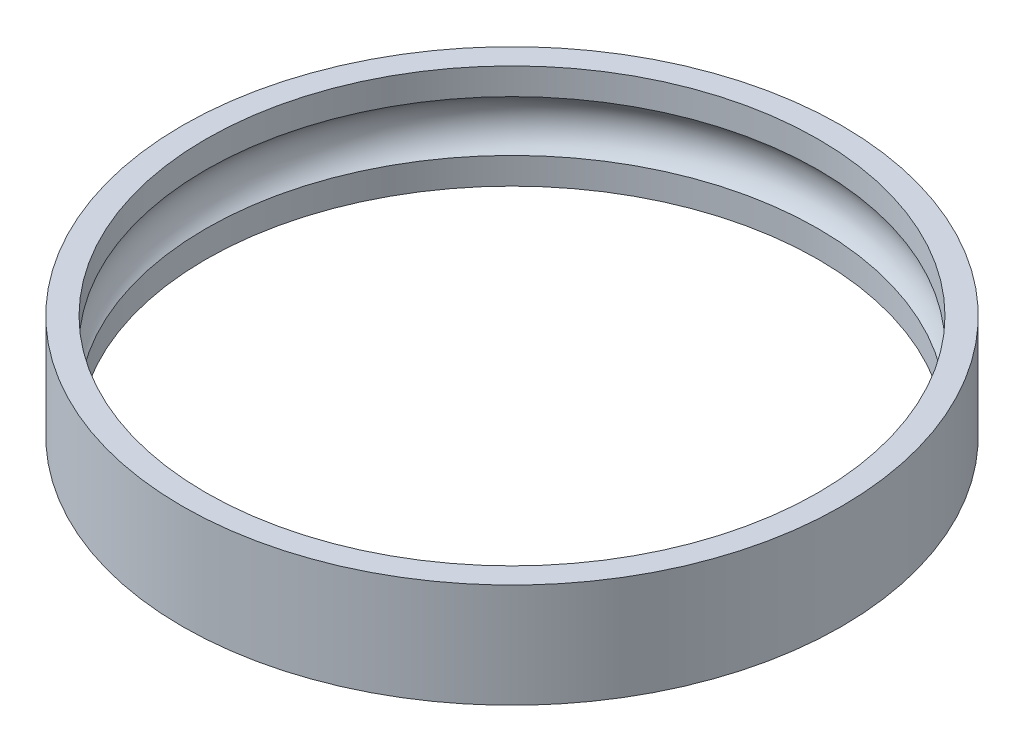
ISO-10303-21;
HEADER;
FILE_DESCRIPTION(('STEP AP214'),'2;1');
FILE_NAME('part.step','',(''),(''),'','','');
FILE_SCHEMA(('AUTOMOTIVE_DESIGN { 1 0 10303 214 1 1 1 1 }'));
ENDSEC;
DATA;
#1=APPLICATION_CONTEXT('core data for automotive mechanical design processes');
#2=APPLICATION_PROTOCOL_DEFINITION('international standard','automotive_design',2000,#1);
#3=PRODUCT_CONTEXT('',#1,'mechanical');
#4=PRODUCT('Part','Part','',(#3));
#5=PRODUCT_RELATED_PRODUCT_CATEGORY('part','',(#4));
#6=PRODUCT_DEFINITION_FORMATION('','',#4);
#7=PRODUCT_DEFINITION_CONTEXT('part definition',#1,'design');
#8=PRODUCT_DEFINITION('design','',#6,#7);
#9=PRODUCT_DEFINITION_SHAPE('','',#8);
#10=(LENGTH_UNIT() NAMED_UNIT(*) SI_UNIT(.MILLI.,.METRE.));
#11=(NAMED_UNIT(*) PLANE_ANGLE_UNIT() SI_UNIT($,.RADIAN.));
#12=(NAMED_UNIT(*) SI_UNIT($,.STERADIAN.) SOLID_ANGLE_UNIT());
#13=UNCERTAINTY_MEASURE_WITH_UNIT(LENGTH_MEASURE(1.E-05),#10,'distance_accuracy_value','');
#14=(GEOMETRIC_REPRESENTATION_CONTEXT(3) GLOBAL_UNCERTAINTY_ASSIGNED_CONTEXT((#13)) GLOBAL_UNIT_ASSIGNED_CONTEXT((#10,
#11,#12)) REPRESENTATION_CONTEXT('',''));
#15=CARTESIAN_POINT('',(0.,0.,0.));
#16=DIRECTION('',(0.,0.,1.));
#17=DIRECTION('',(1.,0.,0.));
#18=AXIS2_PLACEMENT_3D('',#15,#16,#17);
#19=CARTESIAN_POINT('',(0.,0.,0.));
#20=DIRECTION('',(0.,-1.,0.));
#21=DIRECTION('',(0.,0.,-1.));
#22=AXIS2_PLACEMENT_3D('',#19,#20,#21);
#23=CYLINDRICAL_SURFACE('',#22,9.11499999999751);
#24=CARTESIAN_POINT('',(0.,-3.2,0.));
#25=DIRECTION('',(0.,-1.,0.));
#26=DIRECTION('',(0.,0.,-1.));
#27=AXIS2_PLACEMENT_3D('',#24,#25,#26);
#28=CIRCLE('',#27,9.11499999999751);
#29=CARTESIAN_POINT('',(0.,-3.2,-9.11499999999751));
#30=VERTEX_POINT('',#29);
#31=EDGE_CURVE('E19',#30,#30,#28,.T.);
#32=ORIENTED_EDGE('',*,*,#31,.T.);
#33=EDGE_LOOP('',(#32));
#34=FACE_BOUND('',#33,.T.);
#35=CARTESIAN_POINT('',(0.,-2.40778872385596,0.));
#36=DIRECTION('',(0.,-1.,0.));
#37=DIRECTION('',(0.,0.,-1.));
#38=AXIS2_PLACEMENT_3D('',#35,#36,#37);
#39=CIRCLE('',#38,9.11499999999751);
#40=CARTESIAN_POINT('',(0.,-2.40778872385596,-9.11499999999751));
#41=VERTEX_POINT('',#40);
#42=EDGE_CURVE('E43',#41,#41,#39,.T.);
#43=ORIENTED_EDGE('',*,*,#42,.F.);
#44=EDGE_LOOP('',(#43));
#45=FACE_BOUND('',#44,.T.);
#46=ADVANCED_FACE('F15',(#34,#45),#23,.F.);
#47=CARTESIAN_POINT('',(9.115,-3.2,0.));
#48=DIRECTION('',(0.,-1.,0.));
#49=DIRECTION('',(0.,0.,-1.));
#50=AXIS2_PLACEMENT_3D('',#47,#48,#49);
#51=PLANE('',#50);
#52=CARTESIAN_POINT('',(0.,-3.2,0.));
#53=DIRECTION('',(0.,-1.,0.));
#54=DIRECTION('',(0.,0.,-1.));
#55=AXIS2_PLACEMENT_3D('',#52,#53,#54);
#56=CIRCLE('',#55,9.815);
#57=CARTESIAN_POINT('',(0.,-3.2,-9.815));
#58=VERTEX_POINT('',#57);
#59=EDGE_CURVE('E40',#58,#58,#56,.T.);
#60=ORIENTED_EDGE('',*,*,#59,.T.);
#61=EDGE_LOOP('',(#60));
#62=FACE_BOUND('',#61,.T.);
#63=ORIENTED_EDGE('',*,*,#31,.F.);
#64=EDGE_LOOP('',(#63));
#65=FACE_BOUND('',#64,.T.);
#66=ADVANCED_FACE('F58',(#62,#65),#51,.T.);
#67=CARTESIAN_POINT('',(0.,0.,0.));
#68=DIRECTION('',(0.,-1.,0.));
#69=DIRECTION('',(0.,0.,-1.));
#70=AXIS2_PLACEMENT_3D('',#67,#68,#69);
#71=CYLINDRICAL_SURFACE('',#70,9.815);
#72=CARTESIAN_POINT('',(0.,-0.1,0.));
#73=DIRECTION('',(0.,-1.,0.));
#74=DIRECTION('',(0.,0.,-1.));
#75=AXIS2_PLACEMENT_3D('',#72,#73,#74);
#76=CIRCLE('',#75,9.815);
#77=CARTESIAN_POINT('',(0.,-0.1,-9.815));
#78=VERTEX_POINT('',#77);
#79=EDGE_CURVE('E34',#78,#78,#76,.T.);
#80=ORIENTED_EDGE('',*,*,#79,.T.);
#81=EDGE_LOOP('',(#80));
#82=FACE_BOUND('',#81,.T.);
#83=ORIENTED_EDGE('',*,*,#59,.F.);
#84=EDGE_LOOP('',(#83));
#85=FACE_BOUND('',#84,.T.);
#86=ADVANCED_FACE('F60',(#82,#85),#71,.T.);
#87=CARTESIAN_POINT('',(9.815,-0.0999999999999988,0.));
#88=DIRECTION('',(0.,1.,0.));
#89=DIRECTION('',(0.,0.,1.));
#90=AXIS2_PLACEMENT_3D('',#87,#88,#89);
#91=PLANE('',#90);
#92=CARTESIAN_POINT('',(0.,-0.0999999999999973,0.));
#93=DIRECTION('',(0.,-1.,0.));
#94=DIRECTION('',(0.,0.,-1.));
#95=AXIS2_PLACEMENT_3D('',#92,#93,#94);
#96=CIRCLE('',#95,9.115);
#97=CARTESIAN_POINT('',(0.,-0.0999999999999973,-9.115));
#98=VERTEX_POINT('',#97);
#99=EDGE_CURVE('E24',#98,#98,#96,.T.);
#100=ORIENTED_EDGE('',*,*,#99,.T.);
#101=EDGE_LOOP('',(#100));
#102=FACE_BOUND('',#101,.T.);
#103=ORIENTED_EDGE('',*,*,#79,.F.);
#104=EDGE_LOOP('',(#103));
#105=FACE_BOUND('',#104,.T.);
#106=ADVANCED_FACE('F68',(#102,#105),#91,.T.);
#107=CARTESIAN_POINT('',(0.,0.,0.));
#108=DIRECTION('',(0.,-1.,0.));
#109=DIRECTION('',(0.,0.,-1.));
#110=AXIS2_PLACEMENT_3D('',#107,#108,#109);
#111=CYLINDRICAL_SURFACE('',#110,9.115);
#112=CARTESIAN_POINT('',(0.,-0.892211276145687,0.));
#113=DIRECTION('',(0.,-1.,0.));
#114=DIRECTION('',(0.,0.,-1.));
#115=AXIS2_PLACEMENT_3D('',#112,#113,#114);
#116=CIRCLE('',#115,9.115);
#117=CARTESIAN_POINT('',(0.,-0.892211276145687,-9.115));
#118=VERTEX_POINT('',#117);
#119=EDGE_CURVE('E10',#118,#118,#116,.T.);
#120=ORIENTED_EDGE('',*,*,#119,.T.);
#121=EDGE_LOOP('',(#120));
#122=FACE_BOUND('',#121,.T.);
#123=ORIENTED_EDGE('',*,*,#99,.F.);
#124=EDGE_LOOP('',(#123));
#125=FACE_BOUND('',#124,.T.);
#126=ADVANCED_FACE('F74',(#122,#125),#111,.F.);
#127=CARTESIAN_POINT('',(0.,-1.65,0.));
#128=DIRECTION('',(0.,-1.,0.));
#129=DIRECTION('',(0.,0.,-1.));
#130=AXIS2_PLACEMENT_3D('',#127,#128,#129);
#131=TOROIDAL_SURFACE('',#130,8.4625,1.);
#132=ORIENTED_EDGE('',*,*,#42,.T.);
#133=EDGE_LOOP('',(#132));
#134=FACE_BOUND('',#133,.T.);
#135=ORIENTED_EDGE('',*,*,#119,.F.);
#136=EDGE_LOOP('',(#135));
#137=FACE_BOUND('',#136,.T.);
#138=ADVANCED_FACE('F17',(#134,#137),#131,.F.);
#139=CLOSED_SHELL('',(#46,#66,#86,#106,#126,#138));
#140=MANIFOLD_SOLID_BREP('B1',#139);
#141=ADVANCED_BREP_SHAPE_REPRESENTATION('',(#18,#140),#14);
#142=SHAPE_DEFINITION_REPRESENTATION(#9,#141);
ENDSEC;
END-ISO-10303-21;
